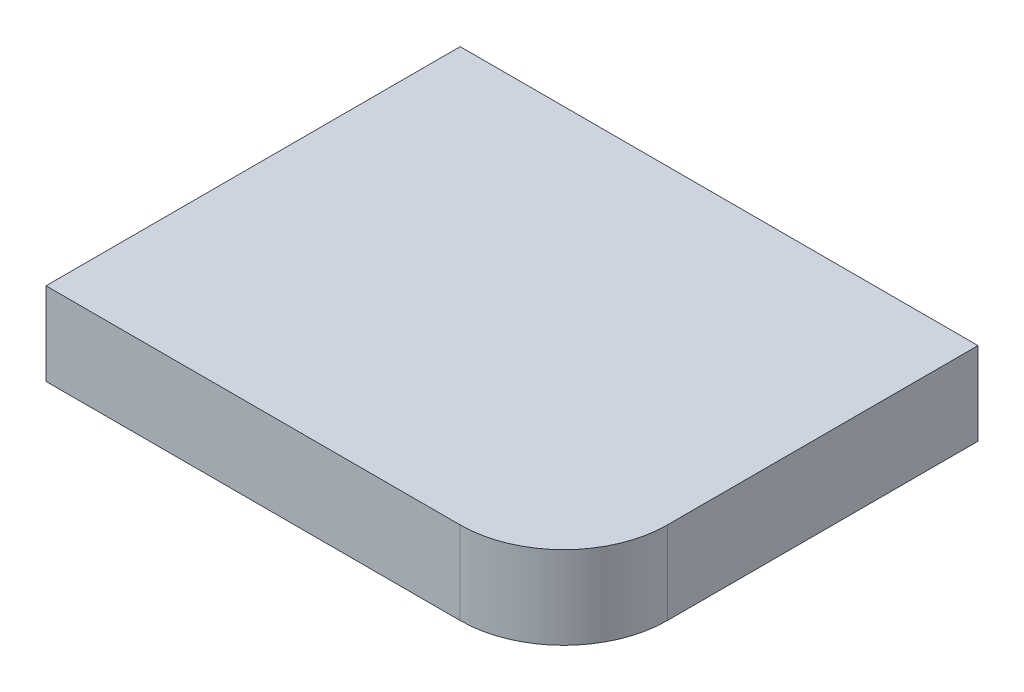
ISO-10303-21;
HEADER;
FILE_DESCRIPTION(('STEP AP214'),'2;1');
FILE_NAME('part.step','',(''),(''),'','','');
FILE_SCHEMA(('AUTOMOTIVE_DESIGN { 1 0 10303 214 1 1 1 1 }'));
ENDSEC;
DATA;
#1=APPLICATION_CONTEXT('core data for automotive mechanical design processes');
#2=APPLICATION_PROTOCOL_DEFINITION('international standard','automotive_design',2000,#1);
#3=PRODUCT_CONTEXT('',#1,'mechanical');
#4=PRODUCT('Part','Part','',(#3));
#5=PRODUCT_RELATED_PRODUCT_CATEGORY('part','',(#4));
#6=PRODUCT_DEFINITION_FORMATION('','',#4);
#7=PRODUCT_DEFINITION_CONTEXT('part definition',#1,'design');
#8=PRODUCT_DEFINITION('design','',#6,#7);
#9=PRODUCT_DEFINITION_SHAPE('','',#8);
#10=(LENGTH_UNIT() NAMED_UNIT(*) SI_UNIT(.MILLI.,.METRE.));
#11=(NAMED_UNIT(*) PLANE_ANGLE_UNIT() SI_UNIT($,.RADIAN.));
#12=(NAMED_UNIT(*) SI_UNIT($,.STERADIAN.) SOLID_ANGLE_UNIT());
#13=UNCERTAINTY_MEASURE_WITH_UNIT(LENGTH_MEASURE(1.E-05),#10,'distance_accuracy_value','');
#14=(GEOMETRIC_REPRESENTATION_CONTEXT(3) GLOBAL_UNCERTAINTY_ASSIGNED_CONTEXT((#13)) GLOBAL_UNIT_ASSIGNED_CONTEXT((#10,
#11,#12)) REPRESENTATION_CONTEXT('',''));
#15=CARTESIAN_POINT('',(0.,0.,0.));
#16=DIRECTION('',(0.,0.,1.));
#17=DIRECTION('',(1.,0.,0.));
#18=AXIS2_PLACEMENT_3D('',#15,#16,#17);
#19=CARTESIAN_POINT('',(25.,8.,10.));
#20=DIRECTION('',(-1.,0.,0.));
#21=DIRECTION('',(0.,0.,1.));
#22=AXIS2_PLACEMENT_3D('',#19,#20,#21);
#23=PLANE('',#22);
#24=DIRECTION('',(0.,0.,-1.));
#25=VECTOR('',#24,1.);
#26=CARTESIAN_POINT('',(25.,0.,10.));
#27=LINE('',#26,#25);
#28=CARTESIAN_POINT('',(25.,0.,10.));
#29=VERTEX_POINT('',#28);
#30=CARTESIAN_POINT('',(25.,0.,-20.));
#31=VERTEX_POINT('',#30);
#32=EDGE_CURVE('E107',#29,#31,#27,.T.);
#33=ORIENTED_EDGE('',*,*,#32,.T.);
#34=DIRECTION('',(0.,-1.,0.));
#35=VECTOR('',#34,1.);
#36=CARTESIAN_POINT('',(25.,8.,-20.));
#37=LINE('',#36,#35);
#38=CARTESIAN_POINT('',(25.,8.,-20.));
#39=VERTEX_POINT('',#38);
#40=EDGE_CURVE('E11',#39,#31,#37,.T.);
#41=ORIENTED_EDGE('',*,*,#40,.F.);
#42=DIRECTION('',(0.,0.,-1.));
#43=VECTOR('',#42,1.);
#44=CARTESIAN_POINT('',(25.,8.,10.));
#45=LINE('',#44,#43);
#46=CARTESIAN_POINT('',(25.,8.,10.));
#47=VERTEX_POINT('',#46);
#48=EDGE_CURVE('E115',#47,#39,#45,.T.);
#49=ORIENTED_EDGE('',*,*,#48,.F.);
#50=DIRECTION('',(0.,-1.,0.));
#51=VECTOR('',#50,1.);
#52=CARTESIAN_POINT('',(25.,8.,10.));
#53=LINE('',#52,#51);
#54=EDGE_CURVE('E103',#47,#29,#53,.T.);
#55=ORIENTED_EDGE('',*,*,#54,.T.);
#56=EDGE_LOOP('',(#33,#41,#49,#55));
#57=FACE_BOUND('',#56,.T.);
#58=ADVANCED_FACE('F33',(#57),#23,.F.);
#59=CARTESIAN_POINT('',(-25.,8.,-20.));
#60=DIRECTION('',(0.,0.,1.));
#61=DIRECTION('',(1.,0.,0.));
#62=AXIS2_PLACEMENT_3D('',#59,#60,#61);
#63=PLANE('',#62);
#64=DIRECTION('',(-1.,0.,0.));
#65=VECTOR('',#64,1.);
#66=CARTESIAN_POINT('',(-25.,0.,-20.));
#67=LINE('',#66,#65);
#68=CARTESIAN_POINT('',(-25.,0.,-20.));
#69=VERTEX_POINT('',#68);
#70=EDGE_CURVE('E110',#31,#69,#67,.T.);
#71=ORIENTED_EDGE('',*,*,#70,.T.);
#72=DIRECTION('',(0.,-1.,0.));
#73=VECTOR('',#72,1.);
#74=CARTESIAN_POINT('',(-25.,8.,-20.));
#75=LINE('',#74,#73);
#76=CARTESIAN_POINT('',(-25.,8.,-20.));
#77=VERTEX_POINT('',#76);
#78=EDGE_CURVE('E41',#77,#69,#75,.T.);
#79=ORIENTED_EDGE('',*,*,#78,.F.);
#80=DIRECTION('',(-1.,0.,0.));
#81=VECTOR('',#80,1.);
#82=CARTESIAN_POINT('',(-25.,8.,-20.));
#83=LINE('',#82,#81);
#84=EDGE_CURVE('E83',#39,#77,#83,.T.);
#85=ORIENTED_EDGE('',*,*,#84,.F.);
#86=ORIENTED_EDGE('',*,*,#40,.T.);
#87=EDGE_LOOP('',(#71,#79,#85,#86));
#88=FACE_BOUND('',#87,.T.);
#89=ADVANCED_FACE('F134',(#88),#63,.F.);
#90=CARTESIAN_POINT('',(-25.,8.,20.));
#91=DIRECTION('',(1.,0.,0.));
#92=DIRECTION('',(0.,0.,-1.));
#93=AXIS2_PLACEMENT_3D('',#90,#91,#92);
#94=PLANE('',#93);
#95=DIRECTION('',(0.,0.,1.));
#96=VECTOR('',#95,1.);
#97=CARTESIAN_POINT('',(-25.,0.,20.));
#98=LINE('',#97,#96);
#99=CARTESIAN_POINT('',(-25.,0.,20.));
#100=VERTEX_POINT('',#99);
#101=EDGE_CURVE('E98',#69,#100,#98,.T.);
#102=ORIENTED_EDGE('',*,*,#101,.T.);
#103=DIRECTION('',(0.,-1.,0.));
#104=VECTOR('',#103,1.);
#105=CARTESIAN_POINT('',(-25.,8.,20.));
#106=LINE('',#105,#104);
#107=CARTESIAN_POINT('',(-25.,8.,20.));
#108=VERTEX_POINT('',#107);
#109=EDGE_CURVE('E95',#108,#100,#106,.T.);
#110=ORIENTED_EDGE('',*,*,#109,.F.);
#111=DIRECTION('',(0.,0.,1.));
#112=VECTOR('',#111,1.);
#113=CARTESIAN_POINT('',(-25.,8.,20.));
#114=LINE('',#113,#112);
#115=EDGE_CURVE('E87',#77,#108,#114,.T.);
#116=ORIENTED_EDGE('',*,*,#115,.F.);
#117=ORIENTED_EDGE('',*,*,#78,.T.);
#118=EDGE_LOOP('',(#102,#110,#116,#117));
#119=FACE_BOUND('',#118,.T.);
#120=ADVANCED_FACE('F96',(#119),#94,.F.);
#121=CARTESIAN_POINT('',(-25.,8.,20.));
#122=DIRECTION('',(0.,0.,-1.));
#123=DIRECTION('',(-1.,0.,0.));
#124=AXIS2_PLACEMENT_3D('',#121,#122,#123);
#125=PLANE('',#124);
#126=DIRECTION('',(1.,0.,0.));
#127=VECTOR('',#126,1.);
#128=CARTESIAN_POINT('',(-25.,0.,20.));
#129=LINE('',#128,#127);
#130=CARTESIAN_POINT('',(15.,0.,20.));
#131=VERTEX_POINT('',#130);
#132=EDGE_CURVE('E69',#100,#131,#129,.T.);
#133=ORIENTED_EDGE('',*,*,#132,.T.);
#134=DIRECTION('',(0.,-1.,0.));
#135=VECTOR('',#134,1.);
#136=CARTESIAN_POINT('',(15.,8.,20.));
#137=LINE('',#136,#135);
#138=CARTESIAN_POINT('',(15.,8.,20.));
#139=VERTEX_POINT('',#138);
#140=EDGE_CURVE('E99',#139,#131,#137,.T.);
#141=ORIENTED_EDGE('',*,*,#140,.F.);
#142=DIRECTION('',(1.,0.,0.));
#143=VECTOR('',#142,1.);
#144=CARTESIAN_POINT('',(-25.,8.,20.));
#145=LINE('',#144,#143);
#146=EDGE_CURVE('E91',#108,#139,#145,.T.);
#147=ORIENTED_EDGE('',*,*,#146,.F.);
#148=ORIENTED_EDGE('',*,*,#109,.T.);
#149=EDGE_LOOP('',(#133,#141,#147,#148));
#150=FACE_BOUND('',#149,.T.);
#151=ADVANCED_FACE('F101',(#150),#125,.F.);
#152=CARTESIAN_POINT('',(15.,8.,10.));
#153=DIRECTION('',(0.,-1.,0.));
#154=DIRECTION('',(0.,0.,-1.));
#155=AXIS2_PLACEMENT_3D('',#152,#153,#154);
#156=CYLINDRICAL_SURFACE('',#155,10.);
#157=CARTESIAN_POINT('',(15.,0.,10.));
#158=DIRECTION('',(0.,1.,0.));
#159=DIRECTION('',(0.,0.,1.));
#160=AXIS2_PLACEMENT_3D('',#157,#158,#159);
#161=CIRCLE('',#160,10.);
#162=EDGE_CURVE('E75',#131,#29,#161,.T.);
#163=ORIENTED_EDGE('',*,*,#162,.T.);
#164=ORIENTED_EDGE('',*,*,#54,.F.);
#165=CARTESIAN_POINT('',(15.,8.,10.));
#166=DIRECTION('',(0.,1.,0.));
#167=DIRECTION('',(0.,0.,1.));
#168=AXIS2_PLACEMENT_3D('',#165,#166,#167);
#169=CIRCLE('',#168,10.);
#170=EDGE_CURVE('E49',#139,#47,#169,.T.);
#171=ORIENTED_EDGE('',*,*,#170,.F.);
#172=ORIENTED_EDGE('',*,*,#140,.T.);
#173=EDGE_LOOP('',(#163,#164,#171,#172));
#174=FACE_BOUND('',#173,.T.);
#175=ADVANCED_FACE('F123',(#174),#156,.T.);
#176=CARTESIAN_POINT('',(15.,8.,10.));
#177=DIRECTION('',(0.,1.,0.));
#178=DIRECTION('',(0.,0.,1.));
#179=AXIS2_PLACEMENT_3D('',#176,#177,#178);
#180=PLANE('',#179);
#181=ORIENTED_EDGE('',*,*,#48,.T.);
#182=ORIENTED_EDGE('',*,*,#84,.T.);
#183=ORIENTED_EDGE('',*,*,#115,.T.);
#184=ORIENTED_EDGE('',*,*,#146,.T.);
#185=ORIENTED_EDGE('',*,*,#170,.T.);
#186=EDGE_LOOP('',(#181,#182,#183,#184,#185));
#187=FACE_BOUND('',#186,.T.);
#188=ADVANCED_FACE('F89',(#187),#180,.T.);
#189=CARTESIAN_POINT('',(15.,0.,10.));
#190=DIRECTION('',(0.,1.,0.));
#191=DIRECTION('',(0.,0.,1.));
#192=AXIS2_PLACEMENT_3D('',#189,#190,#191);
#193=PLANE('',#192);
#194=ORIENTED_EDGE('',*,*,#32,.F.);
#195=ORIENTED_EDGE('',*,*,#162,.F.);
#196=ORIENTED_EDGE('',*,*,#132,.F.);
#197=ORIENTED_EDGE('',*,*,#101,.F.);
#198=ORIENTED_EDGE('',*,*,#70,.F.);
#199=EDGE_LOOP('',(#194,#195,#196,#197,#198));
#200=FACE_BOUND('',#199,.T.);
#201=ADVANCED_FACE('F119',(#200),#193,.F.);
#202=CLOSED_SHELL('',(#58,#89,#120,#151,#175,#188,#201));
#203=MANIFOLD_SOLID_BREP('B2',#202);
#204=ADVANCED_BREP_SHAPE_REPRESENTATION('',(#18,#203),#14);
#205=SHAPE_DEFINITION_REPRESENTATION(#9,#204);
ENDSEC;
END-ISO-10303-21;
